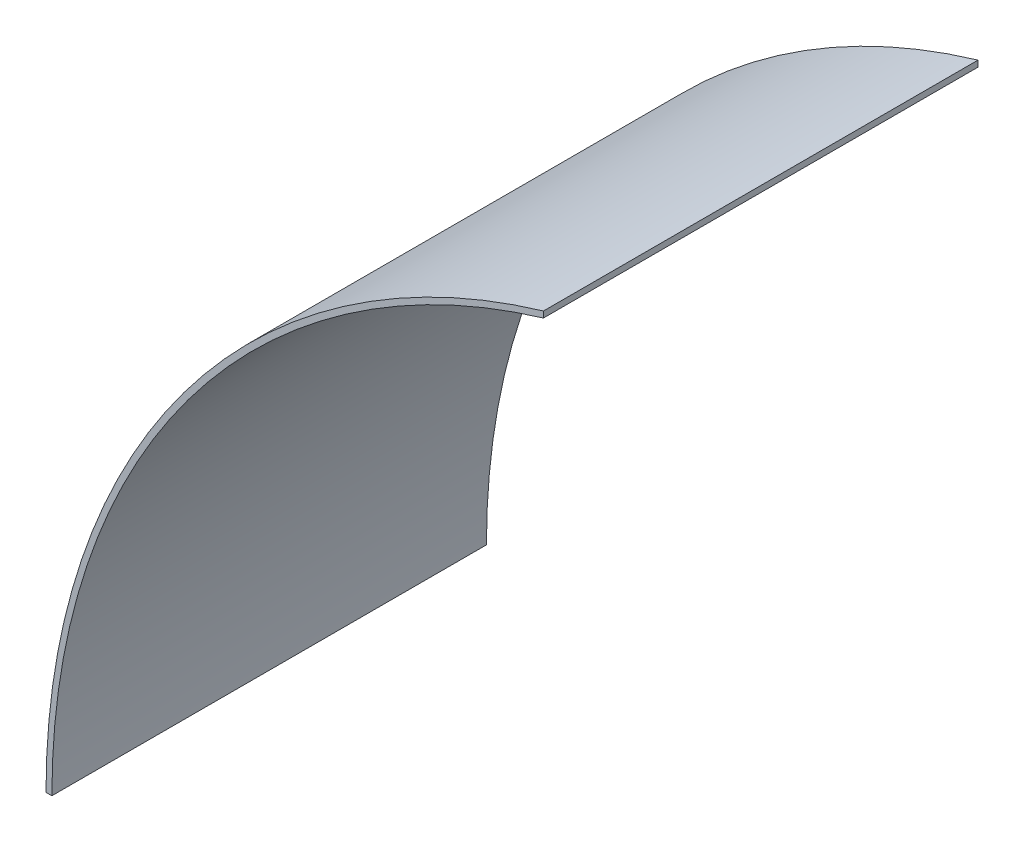
ISO-10303-21;
HEADER;
FILE_DESCRIPTION(('STEP AP214'),'2;1');
FILE_NAME('part.step','',(''),(''),'','','');
FILE_SCHEMA(('AUTOMOTIVE_DESIGN { 1 0 10303 214 1 1 1 1 }'));
ENDSEC;
DATA;
#1=APPLICATION_CONTEXT('core data for automotive mechanical design processes');
#2=APPLICATION_PROTOCOL_DEFINITION('international standard','automotive_design',2000,#1);
#3=PRODUCT_CONTEXT('',#1,'mechanical');
#4=PRODUCT('Part','Part','',(#3));
#5=PRODUCT_RELATED_PRODUCT_CATEGORY('part','',(#4));
#6=PRODUCT_DEFINITION_FORMATION('','',#4);
#7=PRODUCT_DEFINITION_CONTEXT('part definition',#1,'design');
#8=PRODUCT_DEFINITION('design','',#6,#7);
#9=PRODUCT_DEFINITION_SHAPE('','',#8);
#10=(LENGTH_UNIT() NAMED_UNIT(*) SI_UNIT(.MILLI.,.METRE.));
#11=(NAMED_UNIT(*) PLANE_ANGLE_UNIT() SI_UNIT($,.RADIAN.));
#12=(NAMED_UNIT(*) SI_UNIT($,.STERADIAN.) SOLID_ANGLE_UNIT());
#13=UNCERTAINTY_MEASURE_WITH_UNIT(LENGTH_MEASURE(1.E-05),#10,'distance_accuracy_value','');
#14=(GEOMETRIC_REPRESENTATION_CONTEXT(3) GLOBAL_UNCERTAINTY_ASSIGNED_CONTEXT((#13)) GLOBAL_UNIT_ASSIGNED_CONTEXT((#10,
#11,#12)) REPRESENTATION_CONTEXT('',''));
#15=CARTESIAN_POINT('',(0.,0.,0.));
#16=DIRECTION('',(0.,0.,1.));
#17=DIRECTION('',(1.,0.,0.));
#18=AXIS2_PLACEMENT_3D('',#15,#16,#17);
#19=CARTESIAN_POINT('',(0.,0.,112.268));
#20=DIRECTION('',(0.,0.,-1.));
#21=DIRECTION('',(-1.,0.,0.));
#22=AXIS2_PLACEMENT_3D('',#19,#20,#21);
#23=CYLINDRICAL_SURFACE('',#22,179.31892);
#24=CARTESIAN_POINT('',(0.,0.,0.));
#25=DIRECTION('',(0.,0.,1.));
#26=DIRECTION('',(-1.,0.,0.));
#27=AXIS2_PLACEMENT_3D('',#24,#25,#26);
#28=CIRCLE('',#27,179.31892);
#29=CARTESIAN_POINT('',(-50.8,171.972774211404,0.));
#30=VERTEX_POINT('',#29);
#31=CARTESIAN_POINT('',(-179.31892,0.,0.));
#32=VERTEX_POINT('',#31);
#33=EDGE_CURVE('E107',#30,#32,#28,.T.);
#34=ORIENTED_EDGE('',*,*,#33,.T.);
#35=DIRECTION('',(0.,0.,-1.));
#36=VECTOR('',#35,1.);
#37=CARTESIAN_POINT('',(-179.31892,0.,112.268));
#38=LINE('',#37,#36);
#39=CARTESIAN_POINT('',(-179.31892,0.,112.268));
#40=VERTEX_POINT('',#39);
#41=EDGE_CURVE('E11',#40,#32,#38,.T.);
#42=ORIENTED_EDGE('',*,*,#41,.F.);
#43=CARTESIAN_POINT('',(0.,0.,112.268));
#44=DIRECTION('',(0.,0.,1.));
#45=DIRECTION('',(-1.,0.,0.));
#46=AXIS2_PLACEMENT_3D('',#43,#44,#45);
#47=CIRCLE('',#46,179.31892);
#48=CARTESIAN_POINT('',(-50.8,171.972774211404,112.268));
#49=VERTEX_POINT('',#48);
#50=EDGE_CURVE('E91',#49,#40,#47,.T.);
#51=ORIENTED_EDGE('',*,*,#50,.F.);
#52=DIRECTION('',(0.,0.,-1.));
#53=VECTOR('',#52,1.);
#54=CARTESIAN_POINT('',(-50.8,171.972774211404,112.268));
#55=LINE('',#54,#53);
#56=EDGE_CURVE('E103',#49,#30,#55,.T.);
#57=ORIENTED_EDGE('',*,*,#56,.T.);
#58=EDGE_LOOP('',(#34,#42,#51,#57));
#59=FACE_BOUND('',#58,.T.);
#60=ADVANCED_FACE('F39',(#59),#23,.T.);
#61=CARTESIAN_POINT('',(-179.31892,0.,112.268));
#62=DIRECTION('',(0.,1.,0.));
#63=DIRECTION('',(-1.,0.,0.));
#64=AXIS2_PLACEMENT_3D('',#61,#62,#63);
#65=PLANE('',#64);
#66=DIRECTION('',(1.,0.,0.));
#67=VECTOR('',#66,1.);
#68=CARTESIAN_POINT('',(-179.31892,0.,0.));
#69=LINE('',#68,#67);
#70=CARTESIAN_POINT('',(-177.8,0.,0.));
#71=VERTEX_POINT('',#70);
#72=EDGE_CURVE('E96',#32,#71,#69,.T.);
#73=ORIENTED_EDGE('',*,*,#72,.T.);
#74=DIRECTION('',(0.,0.,-1.));
#75=VECTOR('',#74,1.);
#76=CARTESIAN_POINT('',(-177.8,0.,112.268));
#77=LINE('',#76,#75);
#78=CARTESIAN_POINT('',(-177.8,0.,112.268));
#79=VERTEX_POINT('',#78);
#80=EDGE_CURVE('E48',#79,#71,#77,.T.);
#81=ORIENTED_EDGE('',*,*,#80,.F.);
#82=DIRECTION('',(1.,0.,0.));
#83=VECTOR('',#82,1.);
#84=CARTESIAN_POINT('',(-179.31892,0.,112.268));
#85=LINE('',#84,#83);
#86=EDGE_CURVE('E86',#40,#79,#85,.T.);
#87=ORIENTED_EDGE('',*,*,#86,.F.);
#88=ORIENTED_EDGE('',*,*,#41,.T.);
#89=EDGE_LOOP('',(#73,#81,#87,#88));
#90=FACE_BOUND('',#89,.T.);
#91=ADVANCED_FACE('F95',(#90),#65,.F.);
#92=CARTESIAN_POINT('',(0.,0.,112.268));
#93=DIRECTION('',(0.,0.,-1.));
#94=DIRECTION('',(-1.,0.,0.));
#95=AXIS2_PLACEMENT_3D('',#92,#93,#94);
#96=CYLINDRICAL_SURFACE('',#95,177.8);
#97=CARTESIAN_POINT('',(0.,0.,0.));
#98=DIRECTION('',(0.,0.,-1.));
#99=DIRECTION('',(-1.,0.,0.));
#100=AXIS2_PLACEMENT_3D('',#97,#98,#99);
#101=CIRCLE('',#100,177.8);
#102=CARTESIAN_POINT('',(-50.8,170.388379885484,0.));
#103=VERTEX_POINT('',#102);
#104=EDGE_CURVE('E73',#71,#103,#101,.T.);
#105=ORIENTED_EDGE('',*,*,#104,.T.);
#106=DIRECTION('',(0.,0.,-1.));
#107=VECTOR('',#106,1.);
#108=CARTESIAN_POINT('',(-50.8,170.388379885484,112.268));
#109=LINE('',#108,#107);
#110=CARTESIAN_POINT('',(-50.8,170.388379885484,112.268));
#111=VERTEX_POINT('',#110);
#112=EDGE_CURVE('E98',#111,#103,#109,.T.);
#113=ORIENTED_EDGE('',*,*,#112,.F.);
#114=CARTESIAN_POINT('',(0.,0.,112.268));
#115=DIRECTION('',(0.,0.,-1.));
#116=DIRECTION('',(-1.,0.,0.));
#117=AXIS2_PLACEMENT_3D('',#114,#115,#116);
#118=CIRCLE('',#117,177.8);
#119=EDGE_CURVE('E89',#79,#111,#118,.T.);
#120=ORIENTED_EDGE('',*,*,#119,.F.);
#121=ORIENTED_EDGE('',*,*,#80,.T.);
#122=EDGE_LOOP('',(#105,#113,#120,#121));
#123=FACE_BOUND('',#122,.T.);
#124=ADVANCED_FACE('F99',(#123),#96,.F.);
#125=CARTESIAN_POINT('',(-50.8,171.972774211404,112.268));
#126=DIRECTION('',(-1.,0.,0.));
#127=DIRECTION('',(0.,0.,1.));
#128=AXIS2_PLACEMENT_3D('',#125,#126,#127);
#129=PLANE('',#128);
#130=DIRECTION('',(0.,1.,0.));
#131=VECTOR('',#130,1.);
#132=CARTESIAN_POINT('',(-50.8,171.972774211404,0.));
#133=LINE('',#132,#131);
#134=EDGE_CURVE('E79',#103,#30,#133,.T.);
#135=ORIENTED_EDGE('',*,*,#134,.T.);
#136=ORIENTED_EDGE('',*,*,#56,.F.);
#137=DIRECTION('',(0.,1.,0.));
#138=VECTOR('',#137,1.);
#139=CARTESIAN_POINT('',(-50.8,171.972774211404,112.268));
#140=LINE('',#139,#138);
#141=EDGE_CURVE('E56',#111,#49,#140,.T.);
#142=ORIENTED_EDGE('',*,*,#141,.F.);
#143=ORIENTED_EDGE('',*,*,#112,.T.);
#144=EDGE_LOOP('',(#135,#136,#142,#143));
#145=FACE_BOUND('',#144,.T.);
#146=ADVANCED_FACE('F120',(#145),#129,.F.);
#147=CARTESIAN_POINT('',(0.,0.,112.268));
#148=DIRECTION('',(0.,0.,-1.));
#149=DIRECTION('',(-1.,0.,0.));
#150=AXIS2_PLACEMENT_3D('',#147,#148,#149);
#151=PLANE('',#150);
#152=ORIENTED_EDGE('',*,*,#50,.T.);
#153=ORIENTED_EDGE('',*,*,#86,.T.);
#154=ORIENTED_EDGE('',*,*,#119,.T.);
#155=ORIENTED_EDGE('',*,*,#141,.T.);
#156=EDGE_LOOP('',(#152,#153,#154,#155));
#157=FACE_BOUND('',#156,.T.);
#158=ADVANCED_FACE('F87',(#157),#151,.F.);
#159=CARTESIAN_POINT('',(0.,0.,0.));
#160=DIRECTION('',(0.,0.,-1.));
#161=DIRECTION('',(-1.,0.,0.));
#162=AXIS2_PLACEMENT_3D('',#159,#160,#161);
#163=PLANE('',#162);
#164=ORIENTED_EDGE('',*,*,#33,.F.);
#165=ORIENTED_EDGE('',*,*,#134,.F.);
#166=ORIENTED_EDGE('',*,*,#104,.F.);
#167=ORIENTED_EDGE('',*,*,#72,.F.);
#168=EDGE_LOOP('',(#164,#165,#166,#167));
#169=FACE_BOUND('',#168,.T.);
#170=ADVANCED_FACE('F123',(#169),#163,.T.);
#171=CLOSED_SHELL('',(#60,#91,#124,#146,#158,#170));
#172=MANIFOLD_SOLID_BREP('B2',#171);
#173=ADVANCED_BREP_SHAPE_REPRESENTATION('',(#18,#172),#14);
#174=SHAPE_DEFINITION_REPRESENTATION(#9,#173);
ENDSEC;
END-ISO-10303-21;
